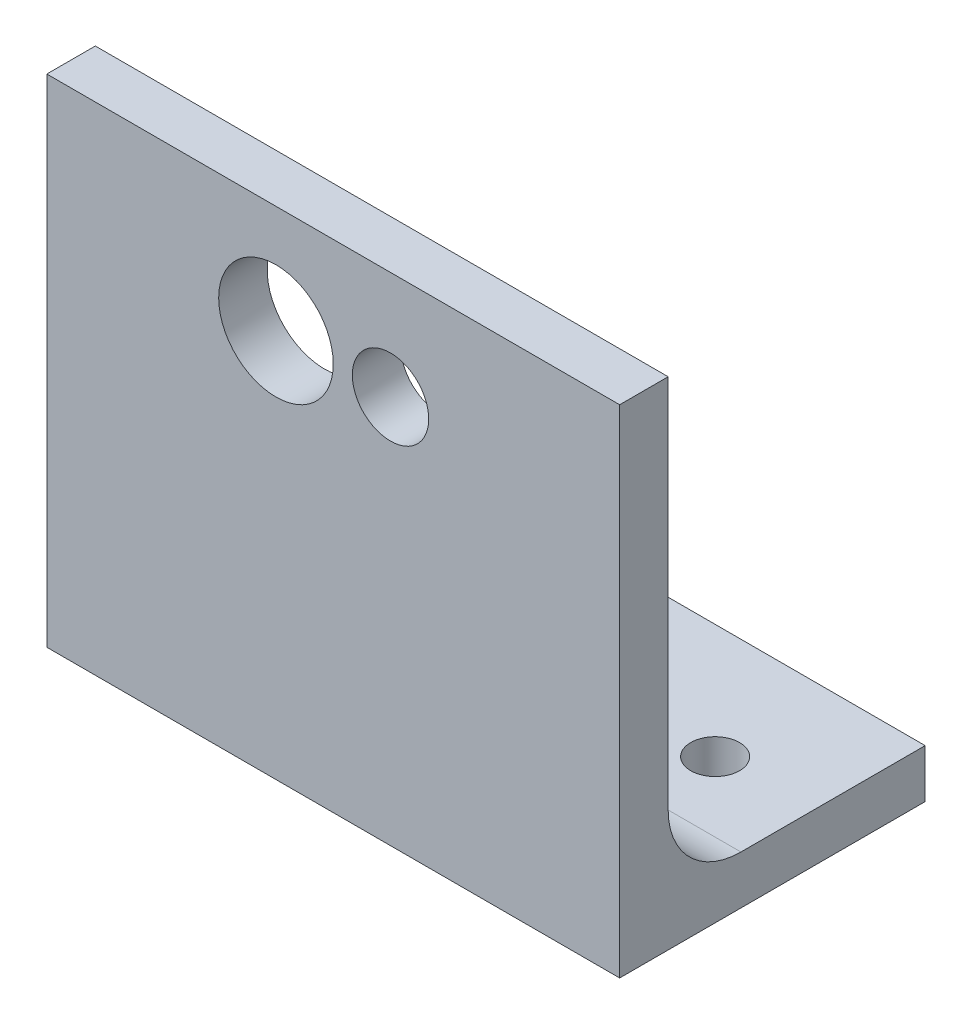
ISO-10303-21;
HEADER;
FILE_DESCRIPTION(('STEP AP214'),'2;1');
FILE_NAME('part.step','',(''),(''),'','','');
FILE_SCHEMA(('AUTOMOTIVE_DESIGN { 1 0 10303 214 1 1 1 1 }'));
ENDSEC;
DATA;
#1=APPLICATION_CONTEXT('core data for automotive mechanical design processes');
#2=APPLICATION_PROTOCOL_DEFINITION('international standard','automotive_design',2000,#1);
#3=PRODUCT_CONTEXT('',#1,'mechanical');
#4=PRODUCT('Part','Part','',(#3));
#5=PRODUCT_RELATED_PRODUCT_CATEGORY('part','',(#4));
#6=PRODUCT_DEFINITION_FORMATION('','',#4);
#7=PRODUCT_DEFINITION_CONTEXT('part definition',#1,'design');
#8=PRODUCT_DEFINITION('design','',#6,#7);
#9=PRODUCT_DEFINITION_SHAPE('','',#8);
#10=(LENGTH_UNIT() NAMED_UNIT(*) SI_UNIT(.MILLI.,.METRE.));
#11=(NAMED_UNIT(*) PLANE_ANGLE_UNIT() SI_UNIT($,.RADIAN.));
#12=(NAMED_UNIT(*) SI_UNIT($,.STERADIAN.) SOLID_ANGLE_UNIT());
#13=UNCERTAINTY_MEASURE_WITH_UNIT(LENGTH_MEASURE(1.E-05),#10,'distance_accuracy_value','');
#14=(GEOMETRIC_REPRESENTATION_CONTEXT(3) GLOBAL_UNCERTAINTY_ASSIGNED_CONTEXT((#13)) GLOBAL_UNIT_ASSIGNED_CONTEXT((#10,
#11,#12)) REPRESENTATION_CONTEXT('',''));
#15=CARTESIAN_POINT('',(0.,0.,0.));
#16=DIRECTION('',(0.,0.,1.));
#17=DIRECTION('',(1.,0.,0.));
#18=AXIS2_PLACEMENT_3D('',#15,#16,#17);
#19=CARTESIAN_POINT('',(75.,15.875,-15.875));
#20=DIRECTION('',(1.,0.,0.));
#21=DIRECTION('',(0.,0.,-1.));
#22=AXIS2_PLACEMENT_3D('',#19,#20,#21);
#23=PLANE('',#22);
#24=DIRECTION('',(0.,1.,0.));
#25=VECTOR('',#24,1.);
#26=CARTESIAN_POINT('',(75.,88.9,-6.35));
#27=LINE('',#26,#25);
#28=CARTESIAN_POINT('',(75.,15.875,-6.35));
#29=VERTEX_POINT('',#28);
#30=CARTESIAN_POINT('',(75.,65.,-6.34999999999999));
#31=VERTEX_POINT('',#30);
#32=EDGE_CURVE('E129',#29,#31,#27,.T.);
#33=ORIENTED_EDGE('',*,*,#32,.T.);
#34=DIRECTION('',(0.,0.,1.));
#35=VECTOR('',#34,1.);
#36=CARTESIAN_POINT('',(75.,65.,-75.));
#37=LINE('',#36,#35);
#38=CARTESIAN_POINT('',(75.,65.,0.));
#39=VERTEX_POINT('',#38);
#40=EDGE_CURVE('E178',#31,#39,#37,.T.);
#41=ORIENTED_EDGE('',*,*,#40,.T.);
#42=DIRECTION('',(0.,-1.,0.));
#43=VECTOR('',#42,1.);
#44=CARTESIAN_POINT('',(75.,0.,0.));
#45=LINE('',#44,#43);
#46=CARTESIAN_POINT('',(75.,0.,0.));
#47=VERTEX_POINT('',#46);
#48=EDGE_CURVE('E64',#39,#47,#45,.T.);
#49=ORIENTED_EDGE('',*,*,#48,.T.);
#50=DIRECTION('',(0.,0.,-1.));
#51=VECTOR('',#50,1.);
#52=CARTESIAN_POINT('',(75.,0.,-40.));
#53=LINE('',#52,#51);
#54=CARTESIAN_POINT('',(75.,0.,-40.));
#55=VERTEX_POINT('',#54);
#56=EDGE_CURVE('E157',#47,#55,#53,.T.);
#57=ORIENTED_EDGE('',*,*,#56,.T.);
#58=DIRECTION('',(0.,1.,0.));
#59=VECTOR('',#58,1.);
#60=CARTESIAN_POINT('',(75.,6.35,-40.));
#61=LINE('',#60,#59);
#62=CARTESIAN_POINT('',(75.,6.35,-40.));
#63=VERTEX_POINT('',#62);
#64=EDGE_CURVE('E98',#55,#63,#61,.T.);
#65=ORIENTED_EDGE('',*,*,#64,.T.);
#66=DIRECTION('',(0.,0.,1.));
#67=VECTOR('',#66,1.);
#68=CARTESIAN_POINT('',(75.,6.35,-15.875));
#69=LINE('',#68,#67);
#70=CARTESIAN_POINT('',(75.,6.35,-15.875));
#71=VERTEX_POINT('',#70);
#72=EDGE_CURVE('E104',#63,#71,#69,.T.);
#73=ORIENTED_EDGE('',*,*,#72,.T.);
#74=CARTESIAN_POINT('',(75.,15.875,-15.875));
#75=DIRECTION('',(-1.,0.,0.));
#76=DIRECTION('',(0.,0.,-1.));
#77=AXIS2_PLACEMENT_3D('',#74,#75,#76);
#78=CIRCLE('',#77,9.525);
#79=EDGE_CURVE('E108',#71,#29,#78,.T.);
#80=ORIENTED_EDGE('',*,*,#79,.T.);
#81=EDGE_LOOP('',(#33,#41,#49,#57,#65,#73,#80));
#82=FACE_BOUND('',#81,.T.);
#83=ADVANCED_FACE('F39',(#82),#23,.T.);
#84=CARTESIAN_POINT('',(0.,15.875,-15.875));
#85=DIRECTION('',(1.,0.,0.));
#86=DIRECTION('',(0.,0.,-1.));
#87=AXIS2_PLACEMENT_3D('',#84,#85,#86);
#88=PLANE('',#87);
#89=DIRECTION('',(0.,0.,1.));
#90=VECTOR('',#89,1.);
#91=CARTESIAN_POINT('',(0.,65.,-15.875));
#92=LINE('',#91,#90);
#93=CARTESIAN_POINT('',(0.,65.,-6.35));
#94=VERTEX_POINT('',#93);
#95=CARTESIAN_POINT('',(0.,65.,0.));
#96=VERTEX_POINT('',#95);
#97=EDGE_CURVE('E11',#94,#96,#92,.T.);
#98=ORIENTED_EDGE('',*,*,#97,.F.);
#99=DIRECTION('',(0.,1.,0.));
#100=VECTOR('',#99,1.);
#101=CARTESIAN_POINT('',(0.,88.9,-6.35));
#102=LINE('',#101,#100);
#103=CARTESIAN_POINT('',(0.,15.875,-6.35));
#104=VERTEX_POINT('',#103);
#105=EDGE_CURVE('E151',#104,#94,#102,.T.);
#106=ORIENTED_EDGE('',*,*,#105,.F.);
#107=CARTESIAN_POINT('',(0.,15.875,-15.875));
#108=DIRECTION('',(-1.,0.,0.));
#109=DIRECTION('',(0.,0.,-1.));
#110=AXIS2_PLACEMENT_3D('',#107,#108,#109);
#111=CIRCLE('',#110,9.525);
#112=CARTESIAN_POINT('',(0.,6.35,-15.875));
#113=VERTEX_POINT('',#112);
#114=EDGE_CURVE('E148',#113,#104,#111,.T.);
#115=ORIENTED_EDGE('',*,*,#114,.F.);
#116=DIRECTION('',(0.,0.,1.));
#117=VECTOR('',#116,1.);
#118=CARTESIAN_POINT('',(0.,6.35,-15.875));
#119=LINE('',#118,#117);
#120=CARTESIAN_POINT('',(0.,6.35,-40.));
#121=VERTEX_POINT('',#120);
#122=EDGE_CURVE('E118',#121,#113,#119,.T.);
#123=ORIENTED_EDGE('',*,*,#122,.F.);
#124=DIRECTION('',(0.,1.,0.));
#125=VECTOR('',#124,1.);
#126=CARTESIAN_POINT('',(0.,6.35,-40.));
#127=LINE('',#126,#125);
#128=CARTESIAN_POINT('',(0.,0.,-40.));
#129=VERTEX_POINT('',#128);
#130=EDGE_CURVE('E142',#129,#121,#127,.T.);
#131=ORIENTED_EDGE('',*,*,#130,.F.);
#132=DIRECTION('',(0.,0.,-1.));
#133=VECTOR('',#132,1.);
#134=CARTESIAN_POINT('',(0.,0.,-40.));
#135=LINE('',#134,#133);
#136=CARTESIAN_POINT('',(0.,0.,0.));
#137=VERTEX_POINT('',#136);
#138=EDGE_CURVE('E138',#137,#129,#135,.T.);
#139=ORIENTED_EDGE('',*,*,#138,.F.);
#140=DIRECTION('',(0.,-1.,0.));
#141=VECTOR('',#140,1.);
#142=CARTESIAN_POINT('',(0.,0.,0.));
#143=LINE('',#142,#141);
#144=EDGE_CURVE('E89',#96,#137,#143,.T.);
#145=ORIENTED_EDGE('',*,*,#144,.F.);
#146=EDGE_LOOP('',(#98,#106,#115,#123,#131,#139,#145));
#147=FACE_BOUND('',#146,.T.);
#148=ADVANCED_FACE('F171',(#147),#88,.F.);
#149=CARTESIAN_POINT('',(75.,0.,-40.));
#150=DIRECTION('',(0.,1.,0.));
#151=DIRECTION('',(0.,0.,1.));
#152=AXIS2_PLACEMENT_3D('',#149,#150,#151);
#153=PLANE('',#152);
#154=CARTESIAN_POINT('',(12.5,0.,-25.));
#155=DIRECTION('',(0.,-1.,0.));
#156=DIRECTION('',(0.,0.,-1.));
#157=AXIS2_PLACEMENT_3D('',#154,#155,#156);
#158=CIRCLE('',#157,3.19999999999999);
#159=CARTESIAN_POINT('',(12.5,0.,-28.2));
#160=VERTEX_POINT('',#159);
#161=EDGE_CURVE('E255',#160,#160,#158,.T.);
#162=ORIENTED_EDGE('',*,*,#161,.F.);
#163=EDGE_LOOP('',(#162));
#164=FACE_BOUND('',#163,.T.);
#165=CARTESIAN_POINT('',(62.5,0.,-25.));
#166=DIRECTION('',(0.,-1.,0.));
#167=DIRECTION('',(0.,0.,-1.));
#168=AXIS2_PLACEMENT_3D('',#165,#166,#167);
#169=CIRCLE('',#168,3.19999999999998);
#170=CARTESIAN_POINT('',(62.5,0.,-28.2));
#171=VERTEX_POINT('',#170);
#172=EDGE_CURVE('E258',#171,#171,#169,.T.);
#173=ORIENTED_EDGE('',*,*,#172,.F.);
#174=EDGE_LOOP('',(#173));
#175=FACE_BOUND('',#174,.T.);
#176=ORIENTED_EDGE('',*,*,#138,.T.);
#177=DIRECTION('',(-1.,0.,0.));
#178=VECTOR('',#177,1.);
#179=CARTESIAN_POINT('',(75.,0.,-40.));
#180=LINE('',#179,#178);
#181=EDGE_CURVE('E49',#55,#129,#180,.T.);
#182=ORIENTED_EDGE('',*,*,#181,.F.);
#183=ORIENTED_EDGE('',*,*,#56,.F.);
#184=DIRECTION('',(-1.,0.,0.));
#185=VECTOR('',#184,1.);
#186=CARTESIAN_POINT('',(75.,0.,0.));
#187=LINE('',#186,#185);
#188=EDGE_CURVE('E137',#47,#137,#187,.T.);
#189=ORIENTED_EDGE('',*,*,#188,.T.);
#190=EDGE_LOOP('',(#176,#182,#183,#189));
#191=FACE_BOUND('',#190,.T.);
#192=ADVANCED_FACE('F41',(#164,#175,#191),#153,.F.);
#193=CARTESIAN_POINT('',(75.,6.35,-40.));
#194=DIRECTION('',(0.,0.,1.));
#195=DIRECTION('',(1.,0.,0.));
#196=AXIS2_PLACEMENT_3D('',#193,#194,#195);
#197=PLANE('',#196);
#198=ORIENTED_EDGE('',*,*,#130,.T.);
#199=DIRECTION('',(-1.,0.,0.));
#200=VECTOR('',#199,1.);
#201=CARTESIAN_POINT('',(75.,6.35,-40.));
#202=LINE('',#201,#200);
#203=EDGE_CURVE('E122',#63,#121,#202,.T.);
#204=ORIENTED_EDGE('',*,*,#203,.F.);
#205=ORIENTED_EDGE('',*,*,#64,.F.);
#206=ORIENTED_EDGE('',*,*,#181,.T.);
#207=EDGE_LOOP('',(#198,#204,#205,#206));
#208=FACE_BOUND('',#207,.T.);
#209=ADVANCED_FACE('F166',(#208),#197,.F.);
#210=CARTESIAN_POINT('',(75.,6.35,-15.875));
#211=DIRECTION('',(0.,-1.,0.));
#212=DIRECTION('',(0.,0.,-1.));
#213=AXIS2_PLACEMENT_3D('',#210,#211,#212);
#214=PLANE('',#213);
#215=CARTESIAN_POINT('',(12.5,6.35,-25.));
#216=DIRECTION('',(0.,-1.,0.));
#217=DIRECTION('',(0.,0.,-1.));
#218=AXIS2_PLACEMENT_3D('',#215,#216,#217);
#219=CIRCLE('',#218,3.19999999999999);
#220=CARTESIAN_POINT('',(12.5,6.35,-28.2));
#221=VERTEX_POINT('',#220);
#222=EDGE_CURVE('E43',#221,#221,#219,.T.);
#223=ORIENTED_EDGE('',*,*,#222,.T.);
#224=EDGE_LOOP('',(#223));
#225=FACE_BOUND('',#224,.T.);
#226=CARTESIAN_POINT('',(62.5,6.35,-25.));
#227=DIRECTION('',(0.,-1.,0.));
#228=DIRECTION('',(0.,0.,-1.));
#229=AXIS2_PLACEMENT_3D('',#226,#227,#228);
#230=CIRCLE('',#229,3.19999999999998);
#231=CARTESIAN_POINT('',(62.5,6.35,-28.2));
#232=VERTEX_POINT('',#231);
#233=EDGE_CURVE('E193',#232,#232,#230,.T.);
#234=ORIENTED_EDGE('',*,*,#233,.T.);
#235=EDGE_LOOP('',(#234));
#236=FACE_BOUND('',#235,.T.);
#237=ORIENTED_EDGE('',*,*,#122,.T.);
#238=DIRECTION('',(-1.,0.,0.));
#239=VECTOR('',#238,1.);
#240=CARTESIAN_POINT('',(75.,6.35,-15.875));
#241=LINE('',#240,#239);
#242=EDGE_CURVE('E115',#71,#113,#241,.T.);
#243=ORIENTED_EDGE('',*,*,#242,.F.);
#244=ORIENTED_EDGE('',*,*,#72,.F.);
#245=ORIENTED_EDGE('',*,*,#203,.T.);
#246=EDGE_LOOP('',(#237,#243,#244,#245));
#247=FACE_BOUND('',#246,.T.);
#248=ADVANCED_FACE('F116',(#225,#236,#247),#214,.F.);
#249=CARTESIAN_POINT('',(75.,15.875,-15.875));
#250=DIRECTION('',(-1.,0.,0.));
#251=DIRECTION('',(0.,0.,1.));
#252=AXIS2_PLACEMENT_3D('',#249,#250,#251);
#253=CYLINDRICAL_SURFACE('',#252,9.525);
#254=ORIENTED_EDGE('',*,*,#114,.T.);
#255=DIRECTION('',(-1.,0.,0.));
#256=VECTOR('',#255,1.);
#257=CARTESIAN_POINT('',(75.,15.875,-6.35));
#258=LINE('',#257,#256);
#259=EDGE_CURVE('E123',#29,#104,#258,.T.);
#260=ORIENTED_EDGE('',*,*,#259,.F.);
#261=ORIENTED_EDGE('',*,*,#79,.F.);
#262=ORIENTED_EDGE('',*,*,#242,.T.);
#263=EDGE_LOOP('',(#254,#260,#261,#262));
#264=FACE_BOUND('',#263,.T.);
#265=ADVANCED_FACE('F125',(#264),#253,.F.);
#266=CARTESIAN_POINT('',(75.,88.9,-6.35));
#267=DIRECTION('',(0.,0.,1.));
#268=DIRECTION('',(1.,0.,0.));
#269=AXIS2_PLACEMENT_3D('',#266,#267,#268);
#270=PLANE('',#269);
#271=DIRECTION('',(-1.,0.,0.));
#272=VECTOR('',#271,1.);
#273=CARTESIAN_POINT('',(75.,65.,-6.35));
#274=LINE('',#273,#272);
#275=EDGE_CURVE('E55',#31,#94,#274,.T.);
#276=ORIENTED_EDGE('',*,*,#275,.F.);
#277=ORIENTED_EDGE('',*,*,#32,.F.);
#278=ORIENTED_EDGE('',*,*,#259,.T.);
#279=ORIENTED_EDGE('',*,*,#105,.T.);
#280=EDGE_LOOP('',(#276,#277,#278,#279));
#281=FACE_BOUND('',#280,.T.);
#282=CARTESIAN_POINT('',(45.,50.875,-6.34999999999999));
#283=DIRECTION('',(0.,0.,1.));
#284=DIRECTION('',(1.,0.,0.));
#285=AXIS2_PLACEMENT_3D('',#282,#283,#284);
#286=CIRCLE('',#285,5.00000000000001);
#287=CARTESIAN_POINT('',(50.,50.875,-6.34999999999999));
#288=VERTEX_POINT('',#287);
#289=EDGE_CURVE('E143',#288,#288,#286,.F.);
#290=ORIENTED_EDGE('',*,*,#289,.F.);
#291=EDGE_LOOP('',(#290));
#292=FACE_BOUND('',#291,.T.);
#293=CARTESIAN_POINT('',(30.,50.875,-6.34999999999999));
#294=DIRECTION('',(0.,0.,1.));
#295=DIRECTION('',(1.,0.,0.));
#296=AXIS2_PLACEMENT_3D('',#293,#294,#295);
#297=CIRCLE('',#296,7.49999999999999);
#298=CARTESIAN_POINT('',(37.5,50.875,-6.34999999999999));
#299=VERTEX_POINT('',#298);
#300=EDGE_CURVE('E201',#299,#299,#297,.F.);
#301=ORIENTED_EDGE('',*,*,#300,.F.);
#302=EDGE_LOOP('',(#301));
#303=FACE_BOUND('',#302,.T.);
#304=ADVANCED_FACE('F175',(#281,#292,#303),#270,.F.);
#305=CARTESIAN_POINT('',(75.,0.,0.));
#306=DIRECTION('',(0.,0.,-1.));
#307=DIRECTION('',(-1.,0.,0.));
#308=AXIS2_PLACEMENT_3D('',#305,#306,#307);
#309=PLANE('',#308);
#310=DIRECTION('',(-1.,0.,0.));
#311=VECTOR('',#310,1.);
#312=CARTESIAN_POINT('',(75.,65.,0.));
#313=LINE('',#312,#311);
#314=EDGE_CURVE('E181',#39,#96,#313,.T.);
#315=ORIENTED_EDGE('',*,*,#314,.T.);
#316=ORIENTED_EDGE('',*,*,#144,.T.);
#317=ORIENTED_EDGE('',*,*,#188,.F.);
#318=ORIENTED_EDGE('',*,*,#48,.F.);
#319=EDGE_LOOP('',(#315,#316,#317,#318));
#320=FACE_BOUND('',#319,.T.);
#321=CARTESIAN_POINT('',(45.,50.875,0.));
#322=DIRECTION('',(0.,0.,-1.));
#323=DIRECTION('',(-1.,0.,0.));
#324=AXIS2_PLACEMENT_3D('',#321,#322,#323);
#325=CIRCLE('',#324,5.00000000000001);
#326=CARTESIAN_POINT('',(40.,50.875,0.));
#327=VERTEX_POINT('',#326);
#328=EDGE_CURVE('E184',#327,#327,#325,.T.);
#329=ORIENTED_EDGE('',*,*,#328,.T.);
#330=EDGE_LOOP('',(#329));
#331=FACE_BOUND('',#330,.T.);
#332=CARTESIAN_POINT('',(30.,50.875,0.));
#333=DIRECTION('',(0.,0.,-1.));
#334=DIRECTION('',(-1.,0.,0.));
#335=AXIS2_PLACEMENT_3D('',#332,#333,#334);
#336=CIRCLE('',#335,7.49999999999999);
#337=CARTESIAN_POINT('',(22.5,50.875,0.));
#338=VERTEX_POINT('',#337);
#339=EDGE_CURVE('E190',#338,#338,#336,.T.);
#340=ORIENTED_EDGE('',*,*,#339,.T.);
#341=EDGE_LOOP('',(#340));
#342=FACE_BOUND('',#341,.T.);
#343=ADVANCED_FACE('F215',(#320,#331,#342),#309,.F.);
#344=CARTESIAN_POINT('',(75.,65.,-75.));
#345=DIRECTION('',(0.,1.,0.));
#346=DIRECTION('',(-1.,0.,0.));
#347=AXIS2_PLACEMENT_3D('',#344,#345,#346);
#348=PLANE('',#347);
#349=ORIENTED_EDGE('',*,*,#275,.T.);
#350=ORIENTED_EDGE('',*,*,#97,.T.);
#351=ORIENTED_EDGE('',*,*,#314,.F.);
#352=ORIENTED_EDGE('',*,*,#40,.F.);
#353=EDGE_LOOP('',(#349,#350,#351,#352));
#354=FACE_BOUND('',#353,.T.);
#355=ADVANCED_FACE('F182',(#354),#348,.T.);
#356=CARTESIAN_POINT('',(30.,50.875,-75.));
#357=DIRECTION('',(0.,0.,1.));
#358=DIRECTION('',(1.,0.,0.));
#359=AXIS2_PLACEMENT_3D('',#356,#357,#358);
#360=CYLINDRICAL_SURFACE('',#359,7.49999999999999);
#361=ORIENTED_EDGE('',*,*,#339,.F.);
#362=EDGE_LOOP('',(#361));
#363=FACE_BOUND('',#362,.T.);
#364=ORIENTED_EDGE('',*,*,#300,.T.);
#365=EDGE_LOOP('',(#364));
#366=FACE_BOUND('',#365,.T.);
#367=ADVANCED_FACE('F219',(#363,#366),#360,.F.);
#368=CARTESIAN_POINT('',(45.,50.875,-75.));
#369=DIRECTION('',(0.,0.,1.));
#370=DIRECTION('',(1.,0.,0.));
#371=AXIS2_PLACEMENT_3D('',#368,#369,#370);
#372=CYLINDRICAL_SURFACE('',#371,5.00000000000001);
#373=ORIENTED_EDGE('',*,*,#328,.F.);
#374=EDGE_LOOP('',(#373));
#375=FACE_BOUND('',#374,.T.);
#376=ORIENTED_EDGE('',*,*,#289,.T.);
#377=EDGE_LOOP('',(#376));
#378=FACE_BOUND('',#377,.T.);
#379=ADVANCED_FACE('F212',(#375,#378),#372,.F.);
#380=CARTESIAN_POINT('',(62.5,0.,-25.));
#381=DIRECTION('',(0.,-1.,0.));
#382=DIRECTION('',(0.,0.,-1.));
#383=AXIS2_PLACEMENT_3D('',#380,#381,#382);
#384=CYLINDRICAL_SURFACE('',#383,3.19999999999998);
#385=ORIENTED_EDGE('',*,*,#172,.T.);
#386=EDGE_LOOP('',(#385));
#387=FACE_BOUND('',#386,.T.);
#388=ORIENTED_EDGE('',*,*,#233,.F.);
#389=EDGE_LOOP('',(#388));
#390=FACE_BOUND('',#389,.T.);
#391=ADVANCED_FACE('F227',(#387,#390),#384,.F.);
#392=CARTESIAN_POINT('',(12.5,0.,-25.));
#393=DIRECTION('',(0.,-1.,0.));
#394=DIRECTION('',(0.,0.,-1.));
#395=AXIS2_PLACEMENT_3D('',#392,#393,#394);
#396=CYLINDRICAL_SURFACE('',#395,3.19999999999999);
#397=ORIENTED_EDGE('',*,*,#161,.T.);
#398=EDGE_LOOP('',(#397));
#399=FACE_BOUND('',#398,.T.);
#400=ORIENTED_EDGE('',*,*,#222,.F.);
#401=EDGE_LOOP('',(#400));
#402=FACE_BOUND('',#401,.T.);
#403=ADVANCED_FACE('F268',(#399,#402),#396,.F.);
#404=CLOSED_SHELL('',(#83,#148,#192,#209,#248,#265,#304,#343,#355,#367,#379,#391,#403));
#405=MANIFOLD_SOLID_BREP('B2',#404);
#406=ADVANCED_BREP_SHAPE_REPRESENTATION('',(#18,#405),#14);
#407=SHAPE_DEFINITION_REPRESENTATION(#9,#406);
ENDSEC;
END-ISO-10303-21;
